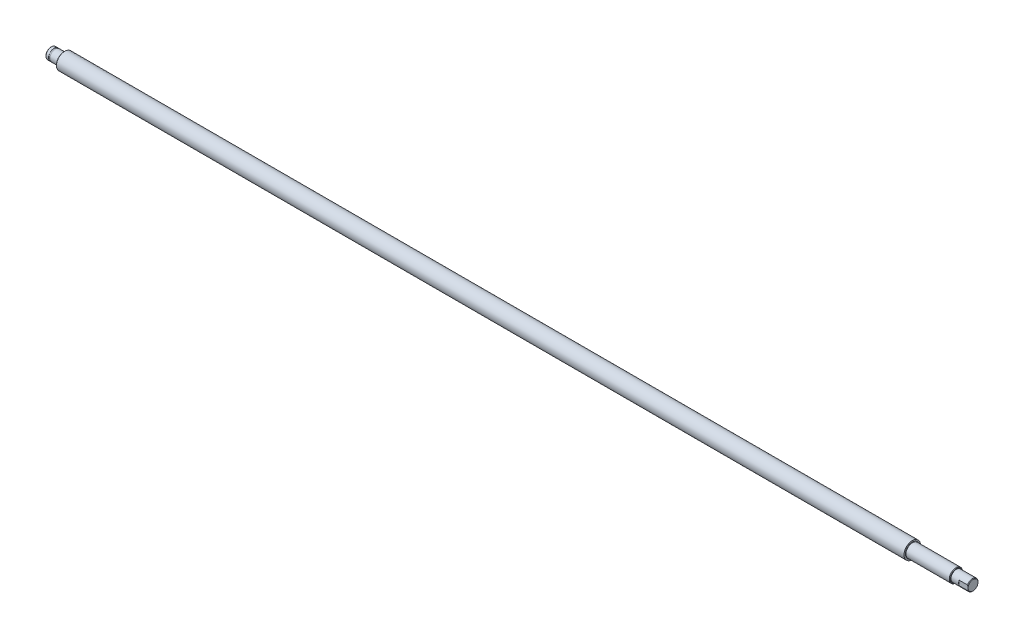
ISO-10303-21;
HEADER;
FILE_DESCRIPTION(('STEP AP214'),'2;1');
FILE_NAME('part.step','',(''),(''),'','','');
FILE_SCHEMA(('AUTOMOTIVE_DESIGN { 1 0 10303 214 1 1 1 1 }'));
ENDSEC;
DATA;
#1=APPLICATION_CONTEXT('core data for automotive mechanical design processes');
#2=APPLICATION_PROTOCOL_DEFINITION('international standard','automotive_design',2000,#1);
#3=PRODUCT_CONTEXT('',#1,'mechanical');
#4=PRODUCT('Part','Part','',(#3));
#5=PRODUCT_RELATED_PRODUCT_CATEGORY('part','',(#4));
#6=PRODUCT_DEFINITION_FORMATION('','',#4);
#7=PRODUCT_DEFINITION_CONTEXT('part definition',#1,'design');
#8=PRODUCT_DEFINITION('design','',#6,#7);
#9=PRODUCT_DEFINITION_SHAPE('','',#8);
#10=(LENGTH_UNIT() NAMED_UNIT(*) SI_UNIT(.MILLI.,.METRE.));
#11=(NAMED_UNIT(*) PLANE_ANGLE_UNIT() SI_UNIT($,.RADIAN.));
#12=(NAMED_UNIT(*) SI_UNIT($,.STERADIAN.) SOLID_ANGLE_UNIT());
#13=UNCERTAINTY_MEASURE_WITH_UNIT(LENGTH_MEASURE(1.E-05),#10,'distance_accuracy_value','');
#14=(GEOMETRIC_REPRESENTATION_CONTEXT(3) GLOBAL_UNCERTAINTY_ASSIGNED_CONTEXT((#13)) GLOBAL_UNIT_ASSIGNED_CONTEXT((#10,
#11,#12)) REPRESENTATION_CONTEXT('',''));
#15=CARTESIAN_POINT('',(0.,0.,0.));
#16=DIRECTION('',(0.,0.,1.));
#17=DIRECTION('',(1.,0.,0.));
#18=AXIS2_PLACEMENT_3D('',#15,#16,#17);
#19=CARTESIAN_POINT('',(0.,2.25,0.));
#20=DIRECTION('',(-1.,0.,0.));
#21=DIRECTION('',(0.,0.,1.));
#22=AXIS2_PLACEMENT_3D('',#19,#20,#21);
#23=PLANE('',#22);
#24=CARTESIAN_POINT('',(0.,0.,0.));
#25=DIRECTION('',(1.,0.,0.));
#26=DIRECTION('',(0.,0.,-1.));
#27=AXIS2_PLACEMENT_3D('',#24,#25,#26);
#28=CIRCLE('',#27,4.50000000000728);
#29=CARTESIAN_POINT('',(0.,0.,-4.50000000000728));
#30=VERTEX_POINT('',#29);
#31=EDGE_CURVE('E175',#30,#30,#28,.T.);
#32=ORIENTED_EDGE('',*,*,#31,.F.);
#33=EDGE_LOOP('',(#32));
#34=FACE_BOUND('',#33,.T.);
#35=ADVANCED_FACE('F17',(#34),#23,.T.);
#36=CARTESIAN_POINT('',(0.499999999988177,0.,0.));
#37=DIRECTION('',(1.,0.,0.));
#38=DIRECTION('',(0.,0.,-1.));
#39=AXIS2_PLACEMENT_3D('',#36,#37,#38);
#40=CONICAL_SURFACE('',#39,4.99999999999545,0.785398163397448);
#41=ORIENTED_EDGE('',*,*,#31,.T.);
#42=EDGE_LOOP('',(#41));
#43=FACE_BOUND('',#42,.T.);
#44=CARTESIAN_POINT('',(0.5,0.,0.));
#45=DIRECTION('',(1.,0.,0.));
#46=DIRECTION('',(0.,0.,-1.));
#47=AXIS2_PLACEMENT_3D('',#44,#45,#46);
#48=CIRCLE('',#47,5.);
#49=CARTESIAN_POINT('',(0.5,0.,-5.));
#50=VERTEX_POINT('',#49);
#51=EDGE_CURVE('E173',#50,#50,#48,.T.);
#52=ORIENTED_EDGE('',*,*,#51,.F.);
#53=EDGE_LOOP('',(#52));
#54=FACE_BOUND('',#53,.T.);
#55=ADVANCED_FACE('F208',(#43,#54),#40,.T.);
#56=CARTESIAN_POINT('',(1.675,0.,0.));
#57=DIRECTION('',(1.,0.,0.));
#58=DIRECTION('',(0.,0.,-1.));
#59=AXIS2_PLACEMENT_3D('',#56,#57,#58);
#60=CYLINDRICAL_SURFACE('',#59,5.);
#61=ORIENTED_EDGE('',*,*,#51,.T.);
#62=EDGE_LOOP('',(#61));
#63=FACE_BOUND('',#62,.T.);
#64=CARTESIAN_POINT('',(2.85,0.,0.));
#65=DIRECTION('',(1.,0.,0.));
#66=DIRECTION('',(0.,0.,-1.));
#67=AXIS2_PLACEMENT_3D('',#64,#65,#66);
#68=CIRCLE('',#67,5.);
#69=CARTESIAN_POINT('',(2.85,0.,-5.));
#70=VERTEX_POINT('',#69);
#71=EDGE_CURVE('E89',#70,#70,#68,.T.);
#72=ORIENTED_EDGE('',*,*,#71,.F.);
#73=EDGE_LOOP('',(#72));
#74=FACE_BOUND('',#73,.T.);
#75=ADVANCED_FACE('F206',(#63,#74),#60,.T.);
#76=CARTESIAN_POINT('',(835.,2.25,0.));
#77=DIRECTION('',(1.,0.,0.));
#78=DIRECTION('',(0.,0.,-1.));
#79=AXIS2_PLACEMENT_3D('',#76,#77,#78);
#80=PLANE('',#79);
#81=CARTESIAN_POINT('',(834.99999999998,0.,0.));
#82=DIRECTION('',(-1.,0.,0.));
#83=DIRECTION('',(0.,0.,1.));
#84=AXIS2_PLACEMENT_3D('',#81,#82,#83);
#85=CIRCLE('',#84,4.49999999995043);
#86=CARTESIAN_POINT('',(834.999999999955,0.,4.49999999997522));
#87=VERTEX_POINT('',#86);
#88=EDGE_CURVE('E73',#87,#87,#85,.T.);
#89=ORIENTED_EDGE('',*,*,#88,.F.);
#90=EDGE_LOOP('',(#89));
#91=FACE_BOUND('',#90,.T.);
#92=ADVANCED_FACE('F201',(#91),#80,.T.);
#93=CARTESIAN_POINT('',(2.85,4.9,0.));
#94=DIRECTION('',(1.,0.,0.));
#95=DIRECTION('',(0.,0.,-1.));
#96=AXIS2_PLACEMENT_3D('',#93,#94,#95);
#97=PLANE('',#96);
#98=CARTESIAN_POINT('',(2.85,0.,0.));
#99=DIRECTION('',(1.,0.,0.));
#100=DIRECTION('',(0.,0.,-1.));
#101=AXIS2_PLACEMENT_3D('',#98,#99,#100);
#102=CIRCLE('',#101,4.8);
#103=CARTESIAN_POINT('',(2.85,0.,-4.8));
#104=VERTEX_POINT('',#103);
#105=EDGE_CURVE('E80',#104,#104,#102,.T.);
#106=ORIENTED_EDGE('',*,*,#105,.F.);
#107=EDGE_LOOP('',(#106));
#108=FACE_BOUND('',#107,.T.);
#109=ORIENTED_EDGE('',*,*,#71,.T.);
#110=EDGE_LOOP('',(#109));
#111=FACE_BOUND('',#110,.T.);
#112=ADVANCED_FACE('F197',(#108,#111),#97,.T.);
#113=CARTESIAN_POINT('',(827.,0.,0.));
#114=DIRECTION('',(1.,0.,0.));
#115=DIRECTION('',(0.,0.,-1.));
#116=AXIS2_PLACEMENT_3D('',#113,#114,#115);
#117=PLANE('',#116);
#118=CARTESIAN_POINT('',(827.,0.,0.));
#119=DIRECTION('',(1.,0.,0.));
#120=DIRECTION('',(0.,0.,-1.));
#121=AXIS2_PLACEMENT_3D('',#118,#119,#120);
#122=CIRCLE('',#121,5.);
#123=CARTESIAN_POINT('',(827.,-2.17944947177034,4.5));
#124=VERTEX_POINT('',#123);
#125=CARTESIAN_POINT('',(827.,2.17944947177034,4.5));
#126=VERTEX_POINT('',#125);
#127=EDGE_CURVE('E170',#124,#126,#122,.F.);
#128=ORIENTED_EDGE('',*,*,#127,.F.);
#129=DIRECTION('',(0.,1.,0.));
#130=VECTOR('',#129,1.);
#131=CARTESIAN_POINT('',(827.,-5.,4.5));
#132=LINE('',#131,#130);
#133=EDGE_CURVE('E86',#124,#126,#132,.T.);
#134=ORIENTED_EDGE('',*,*,#133,.T.);
#135=EDGE_LOOP('',(#128,#134));
#136=FACE_BOUND('',#135,.T.);
#137=ADVANCED_FACE('F200',(#136),#117,.T.);
#138=CARTESIAN_POINT('',(835.,-5.,4.5));
#139=DIRECTION('',(0.,0.,-1.));
#140=DIRECTION('',(-1.,0.,0.));
#141=AXIS2_PLACEMENT_3D('',#138,#139,#140);
#142=PLANE('',#141);
#143=CARTESIAN_POINT('',(834.99999999993,0.,4.50000000000091));
#144=CARTESIAN_POINT('',(835.000005516137,-0.0690619213563722,4.50000000000033));
#145=CARTESIAN_POINT('',(834.998409352386,-0.138113552110971,4.50000000000009));
#146=CARTESIAN_POINT('',(834.992065640724,-0.276061350805217,4.49999999999991));
#147=CARTESIAN_POINT('',(834.987318589319,-0.344957541522603,4.49999999999997));
#148=CARTESIAN_POINT('',(834.968450905798,-0.550996236078554,4.50000000000006));
#149=CARTESIAN_POINT('',(834.949703372552,-0.687737908579918,4.50000000000002));
#150=CARTESIAN_POINT('',(834.901197490724,-0.957259808407382,4.49999999999998));
#151=CARTESIAN_POINT('',(834.871593964484,-1.09006865075965,4.5));
#152=CARTESIAN_POINT('',(834.802673899848,-1.35314232464274,4.5));
#153=CARTESIAN_POINT('',(834.763355871155,-1.48340676252603,4.5));
#154=CARTESIAN_POINT('',(834.687571921792,-1.70810342362817,4.5));
#155=CARTESIAN_POINT('',(834.652953502138,-1.80317008597299,4.5));
#156=CARTESIAN_POINT('',(834.579490634439,-1.99224130101089,4.5));
#157=CARTESIAN_POINT('',(834.54062473622,-2.08623754087062,4.5));
#158=CARTESIAN_POINT('',(834.499999999941,-2.17944947174464,4.5));
#159=B_SPLINE_CURVE_WITH_KNOTS('',3,(#143,#144,#145,#146,#147,#148,#149,#150,#151,#152,#153,
#154,#155,#156,#157,#158),.UNSPECIFIED.,.F.,.F.,(4,2,2,2,2,2,2,4),(0.,0.207147644953754,
0.414262656007666,0.827748343928173,1.2355529380342,1.64342013213201,1.94685221597759,
2.25189442874535),.UNSPECIFIED.);
#160=CARTESIAN_POINT('',(834.499999999971,-2.17944947175749,4.5));
#161=VERTEX_POINT('',#160);
#162=EDGE_CURVE('E76',#87,#161,#159,.T.);
#163=ORIENTED_EDGE('',*,*,#162,.F.);
#164=CARTESIAN_POINT('',(834.499999999948,2.17944947174237,4.50000000001129));
#165=CARTESIAN_POINT('',(834.561992814842,2.03721096496885,4.50000000000406));
#166=CARTESIAN_POINT('',(834.61992769476,1.89304400015675,4.50000000000109));
#167=CARTESIAN_POINT('',(834.725779560696,1.6005742784328,4.49999999999891));
#168=CARTESIAN_POINT('',(834.773663600814,1.45225967202643,4.49999999999971));
#169=CARTESIAN_POINT('',(834.856252187861,1.15513123565644,4.50000000000028));
#170=CARTESIAN_POINT('',(834.891200671563,1.00638643115207,4.50000000000008));
#171=CARTESIAN_POINT('',(834.947252633822,0.706487777741171,4.49999999999993));
#172=CARTESIAN_POINT('',(834.968378608127,0.555338255255098,4.49999999999999));
#173=CARTESIAN_POINT('',(834.987922335162,0.336615873319583,4.50000000000001));
#174=CARTESIAN_POINT('',(834.992432560374,0.269551051377437,4.5));
#175=CARTESIAN_POINT('',(834.998479954441,0.134994911382916,4.5));
#176=CARTESIAN_POINT('',(835.000004081353,0.0675030083509993,4.49999999999999));
#177=CARTESIAN_POINT('',(834.99999999993,0.,4.5));
#178=B_SPLINE_CURVE_WITH_KNOTS('',3,(#164,#165,#166,#167,#168,#169,#170,#171,#172,#173,#174,
#175,#176,#177),.UNSPECIFIED.,.F.,.F.,(4,2,2,2,2,2,4),(0.,0.465642228608897,0.93278775011281,
1.39061107148554,1.84768743248083,2.04927931153788,2.2517497081169),.UNSPECIFIED.);
#179=CARTESIAN_POINT('',(834.499999999972,2.17944947175529,4.5));
#180=VERTEX_POINT('',#179);
#181=EDGE_CURVE('E78',#180,#87,#178,.T.);
#182=ORIENTED_EDGE('',*,*,#181,.F.);
#183=DIRECTION('',(1.,0.,0.));
#184=VECTOR('',#183,1.);
#185=CARTESIAN_POINT('',(827.25,2.17944947177034,4.5));
#186=LINE('',#185,#184);
#187=EDGE_CURVE('E167',#126,#180,#186,.T.);
#188=ORIENTED_EDGE('',*,*,#187,.F.);
#189=ORIENTED_EDGE('',*,*,#133,.F.);
#190=DIRECTION('',(1.,0.,0.));
#191=VECTOR('',#190,1.);
#192=CARTESIAN_POINT('',(827.25,-2.17944947177034,4.5));
#193=LINE('',#192,#191);
#194=EDGE_CURVE('E85',#161,#124,#193,.F.);
#195=ORIENTED_EDGE('',*,*,#194,.F.);
#196=EDGE_LOOP('',(#163,#182,#188,#189,#195));
#197=FACE_BOUND('',#196,.T.);
#198=ADVANCED_FACE('F83',(#197),#142,.F.);
#199=CARTESIAN_POINT('',(834.499999999991,0.,0.));
#200=DIRECTION('',(-1.,0.,0.));
#201=DIRECTION('',(0.,0.,1.));
#202=AXIS2_PLACEMENT_3D('',#199,#200,#201);
#203=CONICAL_SURFACE('',#202,4.99999999993861,0.785398163397448);
#204=ORIENTED_EDGE('',*,*,#181,.T.);
#205=ORIENTED_EDGE('',*,*,#88,.T.);
#206=ORIENTED_EDGE('',*,*,#162,.T.);
#207=CARTESIAN_POINT('',(834.5,0.,0.));
#208=DIRECTION('',(1.,0.,0.));
#209=DIRECTION('',(0.,0.,-1.));
#210=AXIS2_PLACEMENT_3D('',#207,#208,#209);
#211=CIRCLE('',#210,5.);
#212=EDGE_CURVE('E67',#180,#161,#211,.F.);
#213=ORIENTED_EDGE('',*,*,#212,.F.);
#214=EDGE_LOOP('',(#204,#205,#206,#213));
#215=FACE_BOUND('',#214,.T.);
#216=ADVANCED_FACE('F75',(#215),#203,.T.);
#217=CARTESIAN_POINT('',(3.425,0.,0.));
#218=DIRECTION('',(1.,0.,0.));
#219=DIRECTION('',(0.,0.,-1.));
#220=AXIS2_PLACEMENT_3D('',#217,#218,#219);
#221=CYLINDRICAL_SURFACE('',#220,4.8);
#222=ORIENTED_EDGE('',*,*,#105,.T.);
#223=EDGE_LOOP('',(#222));
#224=FACE_BOUND('',#223,.T.);
#225=CARTESIAN_POINT('',(4.,0.,0.));
#226=DIRECTION('',(1.,0.,0.));
#227=DIRECTION('',(0.,0.,-1.));
#228=AXIS2_PLACEMENT_3D('',#225,#226,#227);
#229=CIRCLE('',#228,4.8);
#230=CARTESIAN_POINT('',(4.,0.,-4.8));
#231=VERTEX_POINT('',#230);
#232=EDGE_CURVE('E166',#231,#231,#229,.T.);
#233=ORIENTED_EDGE('',*,*,#232,.F.);
#234=EDGE_LOOP('',(#233));
#235=FACE_BOUND('',#234,.T.);
#236=ADVANCED_FACE('F106',(#224,#235),#221,.T.);
#237=CARTESIAN_POINT('',(827.25,0.,0.));
#238=DIRECTION('',(1.,0.,0.));
#239=DIRECTION('',(0.,0.,-1.));
#240=AXIS2_PLACEMENT_3D('',#237,#238,#239);
#241=CYLINDRICAL_SURFACE('',#240,5.);
#242=CARTESIAN_POINT('',(820.,0.,0.));
#243=DIRECTION('',(1.,0.,0.));
#244=DIRECTION('',(0.,0.,-1.));
#245=AXIS2_PLACEMENT_3D('',#242,#243,#244);
#246=CIRCLE('',#245,5.);
#247=CARTESIAN_POINT('',(820.,0.,-5.));
#248=VERTEX_POINT('',#247);
#249=EDGE_CURVE('E186',#248,#248,#246,.F.);
#250=ORIENTED_EDGE('',*,*,#249,.F.);
#251=EDGE_LOOP('',(#250));
#252=FACE_BOUND('',#251,.T.);
#253=ORIENTED_EDGE('',*,*,#187,.T.);
#254=ORIENTED_EDGE('',*,*,#212,.T.);
#255=ORIENTED_EDGE('',*,*,#194,.T.);
#256=ORIENTED_EDGE('',*,*,#127,.T.);
#257=EDGE_LOOP('',(#253,#254,#255,#256));
#258=FACE_BOUND('',#257,.T.);
#259=ADVANCED_FACE('F110',(#252,#258),#241,.T.);
#260=CARTESIAN_POINT('',(4.,4.9,0.));
#261=DIRECTION('',(-1.,0.,0.));
#262=DIRECTION('',(0.,0.,1.));
#263=AXIS2_PLACEMENT_3D('',#260,#261,#262);
#264=PLANE('',#263);
#265=CARTESIAN_POINT('',(4.,0.,0.));
#266=DIRECTION('',(1.,0.,0.));
#267=DIRECTION('',(0.,0.,-1.));
#268=AXIS2_PLACEMENT_3D('',#265,#266,#267);
#269=CIRCLE('',#268,5.);
#270=CARTESIAN_POINT('',(4.,0.,-5.));
#271=VERTEX_POINT('',#270);
#272=EDGE_CURVE('E183',#271,#271,#269,.T.);
#273=ORIENTED_EDGE('',*,*,#272,.F.);
#274=EDGE_LOOP('',(#273));
#275=FACE_BOUND('',#274,.T.);
#276=ORIENTED_EDGE('',*,*,#232,.T.);
#277=EDGE_LOOP('',(#276));
#278=FACE_BOUND('',#277,.T.);
#279=ADVANCED_FACE('F114',(#275,#278),#264,.T.);
#280=CARTESIAN_POINT('',(820.,5.25,0.));
#281=DIRECTION('',(1.,0.,0.));
#282=DIRECTION('',(0.,0.,-1.));
#283=AXIS2_PLACEMENT_3D('',#280,#281,#282);
#284=PLANE('',#283);
#285=ORIENTED_EDGE('',*,*,#249,.T.);
#286=EDGE_LOOP('',(#285));
#287=FACE_BOUND('',#286,.T.);
#288=CARTESIAN_POINT('',(819.999999999993,0.,0.));
#289=DIRECTION('',(-1.,0.,0.));
#290=DIRECTION('',(0.,0.,1.));
#291=AXIS2_PLACEMENT_3D('',#288,#289,#290);
#292=CIRCLE('',#291,5.50000000004047);
#293=CARTESIAN_POINT('',(819.999999999993,0.,5.50000000004047));
#294=VERTEX_POINT('',#293);
#295=EDGE_CURVE('E164',#294,#294,#292,.T.);
#296=ORIENTED_EDGE('',*,*,#295,.F.);
#297=EDGE_LOOP('',(#296));
#298=FACE_BOUND('',#297,.T.);
#299=ADVANCED_FACE('F118',(#287,#298),#284,.T.);
#300=CARTESIAN_POINT('',(7.85,0.,0.));
#301=DIRECTION('',(1.,0.,0.));
#302=DIRECTION('',(0.,0.,-1.));
#303=AXIS2_PLACEMENT_3D('',#300,#301,#302);
#304=CYLINDRICAL_SURFACE('',#303,5.);
#305=ORIENTED_EDGE('',*,*,#272,.T.);
#306=EDGE_LOOP('',(#305));
#307=FACE_BOUND('',#306,.T.);
#308=CARTESIAN_POINT('',(11.7,0.,0.));
#309=DIRECTION('',(-1.,0.,0.));
#310=DIRECTION('',(0.,0.,1.));
#311=AXIS2_PLACEMENT_3D('',#308,#309,#310);
#312=CIRCLE('',#311,5.);
#313=CARTESIAN_POINT('',(11.7,0.,5.));
#314=VERTEX_POINT('',#313);
#315=EDGE_CURVE('E161',#314,#314,#312,.T.);
#316=ORIENTED_EDGE('',*,*,#315,.T.);
#317=EDGE_LOOP('',(#316));
#318=FACE_BOUND('',#317,.T.);
#319=ADVANCED_FACE('F122',(#307,#318),#304,.T.);
#320=CARTESIAN_POINT('',(819.500000000005,0.,0.));
#321=DIRECTION('',(-1.,0.,0.));
#322=DIRECTION('',(0.,0.,1.));
#323=AXIS2_PLACEMENT_3D('',#320,#321,#322);
#324=CONICAL_SURFACE('',#323,6.00000000002865,0.785398163397448);
#325=CARTESIAN_POINT('',(819.5,0.,0.));
#326=DIRECTION('',(1.,0.,0.));
#327=DIRECTION('',(0.,0.,-1.));
#328=AXIS2_PLACEMENT_3D('',#325,#326,#327);
#329=CIRCLE('',#328,6.00000000000001);
#330=CARTESIAN_POINT('',(819.5,0.,-6.00000000000001));
#331=VERTEX_POINT('',#330);
#332=EDGE_CURVE('E152',#331,#331,#329,.F.);
#333=ORIENTED_EDGE('',*,*,#332,.F.);
#334=EDGE_LOOP('',(#333));
#335=FACE_BOUND('',#334,.T.);
#336=ORIENTED_EDGE('',*,*,#295,.T.);
#337=EDGE_LOOP('',(#336));
#338=FACE_BOUND('',#337,.T.);
#339=ADVANCED_FACE('F126',(#335,#338),#324,.T.);
#340=CARTESIAN_POINT('',(11.7,0.,0.));
#341=DIRECTION('',(-1.,0.,0.));
#342=DIRECTION('',(0.,0.,1.));
#343=AXIS2_PLACEMENT_3D('',#340,#341,#342);
#344=TOROIDAL_SURFACE('',#343,5.3,0.300000000000001);
#345=CARTESIAN_POINT('',(12.,0.,0.));
#346=DIRECTION('',(-1.,0.,0.));
#347=DIRECTION('',(0.,0.,-1.));
#348=AXIS2_PLACEMENT_3D('',#345,#346,#347);
#349=CIRCLE('',#348,5.3);
#350=CARTESIAN_POINT('',(12.,0.,5.3));
#351=VERTEX_POINT('',#350);
#352=CARTESIAN_POINT('',(12.,0.,-5.3));
#353=VERTEX_POINT('',#352);
#354=EDGE_CURVE('E147',#351,#353,#349,.F.);
#355=ORIENTED_EDGE('',*,*,#354,.F.);
#356=CARTESIAN_POINT('',(12.,0.,0.));
#357=DIRECTION('',(-1.,0.,0.));
#358=DIRECTION('',(0.,0.,1.));
#359=AXIS2_PLACEMENT_3D('',#356,#357,#358);
#360=CIRCLE('',#359,5.3);
#361=CARTESIAN_POINT('',(12.,5.3,0.));
#362=VERTEX_POINT('',#361);
#363=EDGE_CURVE('E298',#362,#351,#360,.F.);
#364=ORIENTED_EDGE('',*,*,#363,.F.);
#365=CARTESIAN_POINT('',(12.,0.,0.));
#366=DIRECTION('',(-1.,0.,0.));
#367=DIRECTION('',(0.,1.,0.));
#368=AXIS2_PLACEMENT_3D('',#365,#366,#367);
#369=CIRCLE('',#368,5.3);
#370=EDGE_CURVE('E160',#353,#362,#369,.F.);
#371=ORIENTED_EDGE('',*,*,#370,.F.);
#372=EDGE_LOOP('',(#355,#364,#371));
#373=FACE_BOUND('',#372,.T.);
#374=ORIENTED_EDGE('',*,*,#315,.F.);
#375=EDGE_LOOP('',(#374));
#376=FACE_BOUND('',#375,.T.);
#377=ADVANCED_FACE('F129',(#373,#376),#344,.F.);
#378=CARTESIAN_POINT('',(799.9,0.,0.));
#379=DIRECTION('',(1.,0.,0.));
#380=DIRECTION('',(0.,0.,-1.));
#381=AXIS2_PLACEMENT_3D('',#378,#379,#380);
#382=CYLINDRICAL_SURFACE('',#381,6.00000000000001);
#383=CARTESIAN_POINT('',(780.3,0.,0.));
#384=DIRECTION('',(-1.,0.,0.));
#385=DIRECTION('',(0.,0.,1.));
#386=AXIS2_PLACEMENT_3D('',#383,#384,#385);
#387=CIRCLE('',#386,6.00000000000002);
#388=CARTESIAN_POINT('',(780.3,0.,6.00000000000002));
#389=VERTEX_POINT('',#388);
#390=EDGE_CURVE('E144',#389,#389,#387,.F.);
#391=ORIENTED_EDGE('',*,*,#390,.T.);
#392=EDGE_LOOP('',(#391));
#393=FACE_BOUND('',#392,.T.);
#394=ORIENTED_EDGE('',*,*,#332,.T.);
#395=EDGE_LOOP('',(#394));
#396=FACE_BOUND('',#395,.T.);
#397=ADVANCED_FACE('F135',(#393,#396),#382,.T.);
#398=CARTESIAN_POINT('',(12.,6.15,0.));
#399=DIRECTION('',(-1.,0.,0.));
#400=DIRECTION('',(0.,0.,1.));
#401=AXIS2_PLACEMENT_3D('',#398,#399,#400);
#402=PLANE('',#401);
#403=CARTESIAN_POINT('',(12.,0.,0.));
#404=DIRECTION('',(1.,0.,0.));
#405=DIRECTION('',(0.,0.,-1.));
#406=AXIS2_PLACEMENT_3D('',#403,#404,#405);
#407=CIRCLE('',#406,7.);
#408=CARTESIAN_POINT('',(12.,0.,-7.));
#409=VERTEX_POINT('',#408);
#410=EDGE_CURVE('E177',#409,#409,#407,.T.);
#411=ORIENTED_EDGE('',*,*,#410,.F.);
#412=EDGE_LOOP('',(#411));
#413=FACE_BOUND('',#412,.T.);
#414=ORIENTED_EDGE('',*,*,#363,.T.);
#415=ORIENTED_EDGE('',*,*,#354,.T.);
#416=ORIENTED_EDGE('',*,*,#370,.T.);
#417=EDGE_LOOP('',(#414,#415,#416));
#418=FACE_BOUND('',#417,.T.);
#419=ADVANCED_FACE('F269',(#413,#418),#402,.T.);
#420=CARTESIAN_POINT('',(780.3,0.,0.));
#421=DIRECTION('',(-1.,0.,0.));
#422=DIRECTION('',(0.,0.,1.));
#423=AXIS2_PLACEMENT_3D('',#420,#421,#422);
#424=TOROIDAL_SURFACE('',#423,6.29999999999998,0.299999999999955);
#425=CARTESIAN_POINT('',(780.,0.,0.));
#426=DIRECTION('',(1.,0.,0.));
#427=DIRECTION('',(0.,1.,0.));
#428=AXIS2_PLACEMENT_3D('',#425,#426,#427);
#429=CIRCLE('',#428,6.29999999999999);
#430=CARTESIAN_POINT('',(780.,0.,6.29999999999999));
#431=VERTEX_POINT('',#430);
#432=CARTESIAN_POINT('',(780.,6.3,0.));
#433=VERTEX_POINT('',#432);
#434=EDGE_CURVE('E37',#431,#433,#429,.F.);
#435=ORIENTED_EDGE('',*,*,#434,.F.);
#436=CARTESIAN_POINT('',(780.,0.,0.));
#437=DIRECTION('',(1.,0.,0.));
#438=DIRECTION('',(0.,0.,1.));
#439=AXIS2_PLACEMENT_3D('',#436,#437,#438);
#440=CIRCLE('',#439,6.29999999999999);
#441=CARTESIAN_POINT('',(780.,0.,-6.3));
#442=VERTEX_POINT('',#441);
#443=EDGE_CURVE('E253',#442,#431,#440,.F.);
#444=ORIENTED_EDGE('',*,*,#443,.F.);
#445=CARTESIAN_POINT('',(780.,0.,0.));
#446=DIRECTION('',(1.,0.,0.));
#447=DIRECTION('',(0.,0.,-1.));
#448=AXIS2_PLACEMENT_3D('',#445,#446,#447);
#449=CIRCLE('',#448,6.3);
#450=EDGE_CURVE('E180',#433,#442,#449,.F.);
#451=ORIENTED_EDGE('',*,*,#450,.F.);
#452=EDGE_LOOP('',(#435,#444,#451));
#453=FACE_BOUND('',#452,.T.);
#454=ORIENTED_EDGE('',*,*,#390,.F.);
#455=EDGE_LOOP('',(#454));
#456=FACE_BOUND('',#455,.T.);
#457=ADVANCED_FACE('F266',(#453,#456),#424,.F.);
#458=CARTESIAN_POINT('',(12.5,0.,0.));
#459=DIRECTION('',(1.,0.,0.));
#460=DIRECTION('',(0.,0.,-1.));
#461=AXIS2_PLACEMENT_3D('',#458,#459,#460);
#462=CONICAL_SURFACE('',#461,7.5,0.785398163397448);
#463=ORIENTED_EDGE('',*,*,#410,.T.);
#464=EDGE_LOOP('',(#463));
#465=FACE_BOUND('',#464,.T.);
#466=CARTESIAN_POINT('',(12.5,0.,0.));
#467=DIRECTION('',(1.,0.,0.));
#468=DIRECTION('',(0.,0.,-1.));
#469=AXIS2_PLACEMENT_3D('',#466,#467,#468);
#470=CIRCLE('',#469,7.5);
#471=CARTESIAN_POINT('',(12.5,0.,-7.5));
#472=VERTEX_POINT('',#471);
#473=EDGE_CURVE('E28',#472,#472,#470,.T.);
#474=ORIENTED_EDGE('',*,*,#473,.F.);
#475=EDGE_LOOP('',(#474));
#476=FACE_BOUND('',#475,.T.);
#477=ADVANCED_FACE('F226',(#465,#476),#462,.T.);
#478=CARTESIAN_POINT('',(780.,6.9,0.));
#479=DIRECTION('',(1.,0.,0.));
#480=DIRECTION('',(0.,0.,-1.));
#481=AXIS2_PLACEMENT_3D('',#478,#479,#480);
#482=PLANE('',#481);
#483=ORIENTED_EDGE('',*,*,#443,.T.);
#484=ORIENTED_EDGE('',*,*,#434,.T.);
#485=ORIENTED_EDGE('',*,*,#450,.T.);
#486=EDGE_LOOP('',(#483,#484,#485));
#487=FACE_BOUND('',#486,.T.);
#488=CARTESIAN_POINT('',(780.,0.,0.));
#489=DIRECTION('',(1.,0.,0.));
#490=DIRECTION('',(0.,0.,-1.));
#491=AXIS2_PLACEMENT_3D('',#488,#489,#490);
#492=CIRCLE('',#491,7.5);
#493=CARTESIAN_POINT('',(780.,0.,-7.5));
#494=VERTEX_POINT('',#493);
#495=EDGE_CURVE('E11',#494,#494,#492,.F.);
#496=ORIENTED_EDGE('',*,*,#495,.F.);
#497=EDGE_LOOP('',(#496));
#498=FACE_BOUND('',#497,.T.);
#499=ADVANCED_FACE('F220',(#487,#498),#482,.T.);
#500=CARTESIAN_POINT('',(396.25,0.,0.));
#501=DIRECTION('',(1.,0.,0.));
#502=DIRECTION('',(0.,0.,-1.));
#503=AXIS2_PLACEMENT_3D('',#500,#501,#502);
#504=CYLINDRICAL_SURFACE('',#503,7.5);
#505=ORIENTED_EDGE('',*,*,#473,.T.);
#506=EDGE_LOOP('',(#505));
#507=FACE_BOUND('',#506,.T.);
#508=ORIENTED_EDGE('',*,*,#495,.T.);
#509=EDGE_LOOP('',(#508));
#510=FACE_BOUND('',#509,.T.);
#511=ADVANCED_FACE('F218',(#507,#510),#504,.T.);
#512=CLOSED_SHELL('',(#35,#55,#75,#92,#112,#137,#198,#216,#236,#259,#279,#299,#319,#339,#377,
#397,#419,#457,#477,#499,#511));
#513=MANIFOLD_SOLID_BREP('B1',#512);
#514=ADVANCED_BREP_SHAPE_REPRESENTATION('',(#18,#513),#14);
#515=SHAPE_DEFINITION_REPRESENTATION(#9,#514);
ENDSEC;
END-ISO-10303-21;
